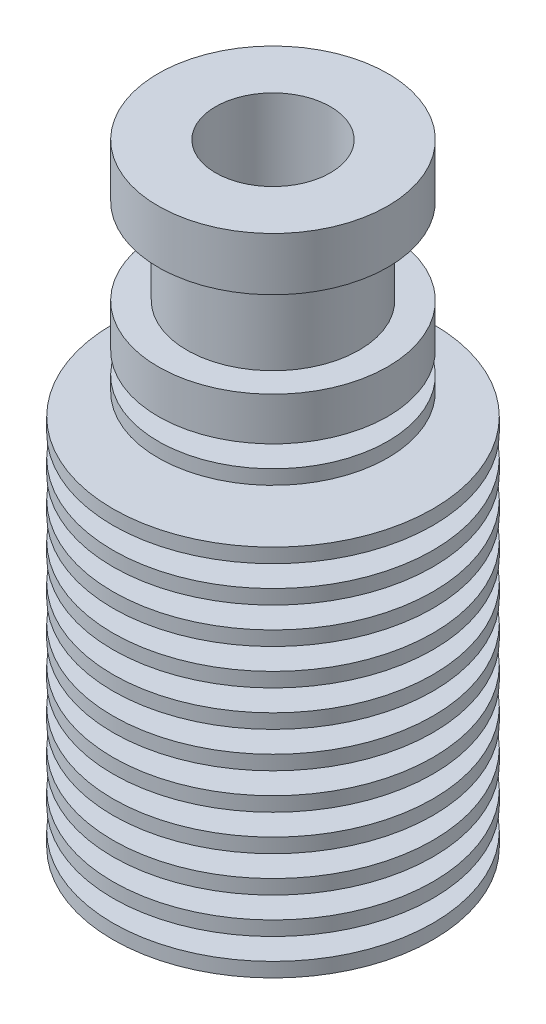
ISO-10303-21;
HEADER;
FILE_DESCRIPTION(('STEP AP214'),'2;1');
FILE_NAME('part.step','',(''),(''),'','','');
FILE_SCHEMA(('AUTOMOTIVE_DESIGN { 1 0 10303 214 1 1 1 1 }'));
ENDSEC;
DATA;
#1=APPLICATION_CONTEXT('core data for automotive mechanical design processes');
#2=APPLICATION_PROTOCOL_DEFINITION('international standard','automotive_design',2000,#1);
#3=PRODUCT_CONTEXT('',#1,'mechanical');
#4=PRODUCT('Part','Part','',(#3));
#5=PRODUCT_RELATED_PRODUCT_CATEGORY('part','',(#4));
#6=PRODUCT_DEFINITION_FORMATION('','',#4);
#7=PRODUCT_DEFINITION_CONTEXT('part definition',#1,'design');
#8=PRODUCT_DEFINITION('design','',#6,#7);
#9=PRODUCT_DEFINITION_SHAPE('','',#8);
#10=(LENGTH_UNIT() NAMED_UNIT(*) SI_UNIT(.MILLI.,.METRE.));
#11=(NAMED_UNIT(*) PLANE_ANGLE_UNIT() SI_UNIT($,.RADIAN.));
#12=(NAMED_UNIT(*) SI_UNIT($,.STERADIAN.) SOLID_ANGLE_UNIT());
#13=UNCERTAINTY_MEASURE_WITH_UNIT(LENGTH_MEASURE(1.E-05),#10,'distance_accuracy_value','');
#14=(GEOMETRIC_REPRESENTATION_CONTEXT(3) GLOBAL_UNCERTAINTY_ASSIGNED_CONTEXT((#13)) GLOBAL_UNIT_ASSIGNED_CONTEXT((#10,
#11,#12)) REPRESENTATION_CONTEXT('',''));
#15=CARTESIAN_POINT('',(0.,0.,0.));
#16=DIRECTION('',(0.,0.,1.));
#17=DIRECTION('',(1.,0.,0.));
#18=AXIS2_PLACEMENT_3D('',#15,#16,#17);
#19=CARTESIAN_POINT('',(0.,0.,0.));
#20=DIRECTION('',(0.,-1.,0.));
#21=DIRECTION('',(1.,0.,0.));
#22=AXIS2_PLACEMENT_3D('',#19,#20,#21);
#23=PLANE('',#22);
#24=CARTESIAN_POINT('',(0.,0.,0.));
#25=DIRECTION('',(0.,-1.,0.));
#26=DIRECTION('',(1.,0.,0.));
#27=AXIS2_PLACEMENT_3D('',#24,#25,#26);
#28=CIRCLE('',#27,4.);
#29=CARTESIAN_POINT('',(4.,0.,0.));
#30=VERTEX_POINT('',#29);
#31=EDGE_CURVE('E228',#30,#30,#28,.T.);
#32=ORIENTED_EDGE('',*,*,#31,.T.);
#33=EDGE_LOOP('',(#32));
#34=FACE_BOUND('',#33,.T.);
#35=CARTESIAN_POINT('',(0.,0.,0.));
#36=DIRECTION('',(0.,-1.,0.));
#37=DIRECTION('',(1.,0.,0.));
#38=AXIS2_PLACEMENT_3D('',#35,#36,#37);
#39=CIRCLE('',#38,8.00000000000001);
#40=CARTESIAN_POINT('',(8.00000000000001,0.,0.));
#41=VERTEX_POINT('',#40);
#42=EDGE_CURVE('E10',#41,#41,#39,.T.);
#43=ORIENTED_EDGE('',*,*,#42,.F.);
#44=EDGE_LOOP('',(#43));
#45=FACE_BOUND('',#44,.T.);
#46=ADVANCED_FACE('F32',(#34,#45),#23,.F.);
#47=CARTESIAN_POINT('',(0.,-42.7,0.));
#48=DIRECTION('',(0.,-1.,0.));
#49=DIRECTION('',(1.,0.,0.));
#50=AXIS2_PLACEMENT_3D('',#47,#48,#49);
#51=CYLINDRICAL_SURFACE('',#50,8.);
#52=CARTESIAN_POINT('',(0.,-3.7,0.));
#53=DIRECTION('',(0.,-1.,0.));
#54=DIRECTION('',(1.,0.,0.));
#55=AXIS2_PLACEMENT_3D('',#52,#53,#54);
#56=CIRCLE('',#55,8.);
#57=CARTESIAN_POINT('',(8.,-3.7,0.));
#58=VERTEX_POINT('',#57);
#59=EDGE_CURVE('E39',#58,#58,#56,.T.);
#60=ORIENTED_EDGE('',*,*,#59,.F.);
#61=EDGE_LOOP('',(#60));
#62=FACE_BOUND('',#61,.T.);
#63=ORIENTED_EDGE('',*,*,#42,.T.);
#64=EDGE_LOOP('',(#63));
#65=FACE_BOUND('',#64,.T.);
#66=ADVANCED_FACE('F715',(#62,#65),#51,.T.);
#67=CARTESIAN_POINT('',(-8.,-3.7,0.));
#68=DIRECTION('',(0.,1.,0.));
#69=DIRECTION('',(-1.,0.,0.));
#70=AXIS2_PLACEMENT_3D('',#67,#68,#69);
#71=PLANE('',#70);
#72=CARTESIAN_POINT('',(0.,-3.7,0.));
#73=DIRECTION('',(0.,-1.,0.));
#74=DIRECTION('',(1.,0.,0.));
#75=AXIS2_PLACEMENT_3D('',#72,#73,#74);
#76=CIRCLE('',#75,6.);
#77=CARTESIAN_POINT('',(6.,-3.7,0.));
#78=VERTEX_POINT('',#77);
#79=EDGE_CURVE('E43',#78,#78,#76,.T.);
#80=ORIENTED_EDGE('',*,*,#79,.F.);
#81=EDGE_LOOP('',(#80));
#82=FACE_BOUND('',#81,.T.);
#83=ORIENTED_EDGE('',*,*,#59,.T.);
#84=EDGE_LOOP('',(#83));
#85=FACE_BOUND('',#84,.T.);
#86=ADVANCED_FACE('F709',(#82,#85),#71,.F.);
#87=CARTESIAN_POINT('',(0.,-42.7,0.));
#88=DIRECTION('',(0.,-1.,0.));
#89=DIRECTION('',(1.,0.,0.));
#90=AXIS2_PLACEMENT_3D('',#87,#88,#89);
#91=CYLINDRICAL_SURFACE('',#90,6.);
#92=CARTESIAN_POINT('',(0.,-9.7,0.));
#93=DIRECTION('',(0.,-1.,0.));
#94=DIRECTION('',(1.,0.,0.));
#95=AXIS2_PLACEMENT_3D('',#92,#93,#94);
#96=CIRCLE('',#95,6.);
#97=CARTESIAN_POINT('',(6.,-9.7,0.));
#98=VERTEX_POINT('',#97);
#99=EDGE_CURVE('E48',#98,#98,#96,.T.);
#100=ORIENTED_EDGE('',*,*,#99,.F.);
#101=EDGE_LOOP('',(#100));
#102=FACE_BOUND('',#101,.T.);
#103=ORIENTED_EDGE('',*,*,#79,.T.);
#104=EDGE_LOOP('',(#103));
#105=FACE_BOUND('',#104,.T.);
#106=ADVANCED_FACE('F700',(#102,#105),#91,.T.);
#107=CARTESIAN_POINT('',(-6.,-9.7,0.));
#108=DIRECTION('',(0.,-1.,0.));
#109=DIRECTION('',(1.,0.,0.));
#110=AXIS2_PLACEMENT_3D('',#107,#108,#109);
#111=PLANE('',#110);
#112=CARTESIAN_POINT('',(0.,-9.7,0.));
#113=DIRECTION('',(0.,-1.,0.));
#114=DIRECTION('',(1.,0.,0.));
#115=AXIS2_PLACEMENT_3D('',#112,#113,#114);
#116=CIRCLE('',#115,8.00000000000001);
#117=CARTESIAN_POINT('',(8.00000000000001,-9.7,0.));
#118=VERTEX_POINT('',#117);
#119=EDGE_CURVE('E52',#118,#118,#116,.T.);
#120=ORIENTED_EDGE('',*,*,#119,.F.);
#121=EDGE_LOOP('',(#120));
#122=FACE_BOUND('',#121,.T.);
#123=ORIENTED_EDGE('',*,*,#99,.T.);
#124=EDGE_LOOP('',(#123));
#125=FACE_BOUND('',#124,.T.);
#126=ADVANCED_FACE('F692',(#122,#125),#111,.F.);
#127=CARTESIAN_POINT('',(0.,-42.7,0.));
#128=DIRECTION('',(0.,-1.,0.));
#129=DIRECTION('',(1.,0.,0.));
#130=AXIS2_PLACEMENT_3D('',#127,#128,#129);
#131=CYLINDRICAL_SURFACE('',#130,8.00000000000001);
#132=CARTESIAN_POINT('',(0.,-12.7,0.));
#133=DIRECTION('',(0.,-1.,0.));
#134=DIRECTION('',(1.,0.,0.));
#135=AXIS2_PLACEMENT_3D('',#132,#133,#134);
#136=CIRCLE('',#135,8.00000000000001);
#137=CARTESIAN_POINT('',(8.00000000000001,-12.7,0.));
#138=VERTEX_POINT('',#137);
#139=EDGE_CURVE('E56',#138,#138,#136,.T.);
#140=ORIENTED_EDGE('',*,*,#139,.F.);
#141=EDGE_LOOP('',(#140));
#142=FACE_BOUND('',#141,.T.);
#143=ORIENTED_EDGE('',*,*,#119,.T.);
#144=EDGE_LOOP('',(#143));
#145=FACE_BOUND('',#144,.T.);
#146=ADVANCED_FACE('F684',(#142,#145),#131,.T.);
#147=CARTESIAN_POINT('',(-8.00000000000001,-12.7,0.));
#148=DIRECTION('',(0.,1.,0.));
#149=DIRECTION('',(-1.,0.,0.));
#150=AXIS2_PLACEMENT_3D('',#147,#148,#149);
#151=PLANE('',#150);
#152=CARTESIAN_POINT('',(0.,-12.7,0.));
#153=DIRECTION('',(0.,-1.,0.));
#154=DIRECTION('',(1.,0.,0.));
#155=AXIS2_PLACEMENT_3D('',#152,#153,#154);
#156=CIRCLE('',#155,4.5);
#157=CARTESIAN_POINT('',(4.5,-12.7,0.));
#158=VERTEX_POINT('',#157);
#159=EDGE_CURVE('E59',#158,#158,#156,.T.);
#160=ORIENTED_EDGE('',*,*,#159,.F.);
#161=EDGE_LOOP('',(#160));
#162=FACE_BOUND('',#161,.T.);
#163=ORIENTED_EDGE('',*,*,#139,.T.);
#164=EDGE_LOOP('',(#163));
#165=FACE_BOUND('',#164,.T.);
#166=ADVANCED_FACE('F676',(#162,#165),#151,.F.);
#167=CARTESIAN_POINT('',(0.,-42.7,0.));
#168=DIRECTION('',(0.,-1.,0.));
#169=DIRECTION('',(1.,0.,0.));
#170=AXIS2_PLACEMENT_3D('',#167,#168,#169);
#171=CYLINDRICAL_SURFACE('',#170,4.5);
#172=CARTESIAN_POINT('',(0.,-14.2,0.));
#173=DIRECTION('',(0.,-1.,0.));
#174=DIRECTION('',(1.,0.,0.));
#175=AXIS2_PLACEMENT_3D('',#172,#173,#174);
#176=CIRCLE('',#175,4.5);
#177=CARTESIAN_POINT('',(4.5,-14.2,0.));
#178=VERTEX_POINT('',#177);
#179=EDGE_CURVE('E62',#178,#178,#176,.T.);
#180=ORIENTED_EDGE('',*,*,#179,.F.);
#181=EDGE_LOOP('',(#180));
#182=FACE_BOUND('',#181,.T.);
#183=ORIENTED_EDGE('',*,*,#159,.T.);
#184=EDGE_LOOP('',(#183));
#185=FACE_BOUND('',#184,.T.);
#186=ADVANCED_FACE('F668',(#182,#185),#171,.T.);
#187=CARTESIAN_POINT('',(-4.5,-14.2,0.));
#188=DIRECTION('',(0.,-1.,0.));
#189=DIRECTION('',(1.,0.,0.));
#190=AXIS2_PLACEMENT_3D('',#187,#188,#189);
#191=PLANE('',#190);
#192=CARTESIAN_POINT('',(0.,-14.2,0.));
#193=DIRECTION('',(0.,-1.,0.));
#194=DIRECTION('',(1.,0.,0.));
#195=AXIS2_PLACEMENT_3D('',#192,#193,#194);
#196=CIRCLE('',#195,8.00000000000001);
#197=CARTESIAN_POINT('',(8.00000000000001,-14.2,0.));
#198=VERTEX_POINT('',#197);
#199=EDGE_CURVE('E66',#198,#198,#196,.T.);
#200=ORIENTED_EDGE('',*,*,#199,.F.);
#201=EDGE_LOOP('',(#200));
#202=FACE_BOUND('',#201,.T.);
#203=ORIENTED_EDGE('',*,*,#179,.T.);
#204=EDGE_LOOP('',(#203));
#205=FACE_BOUND('',#204,.T.);
#206=ADVANCED_FACE('F660',(#202,#205),#191,.F.);
#207=CARTESIAN_POINT('',(0.,-42.7,0.));
#208=DIRECTION('',(0.,-1.,0.));
#209=DIRECTION('',(1.,0.,0.));
#210=AXIS2_PLACEMENT_3D('',#207,#208,#209);
#211=CYLINDRICAL_SURFACE('',#210,8.00000000000001);
#212=CARTESIAN_POINT('',(0.,-15.2,0.));
#213=DIRECTION('',(0.,-1.,0.));
#214=DIRECTION('',(1.,0.,0.));
#215=AXIS2_PLACEMENT_3D('',#212,#213,#214);
#216=CIRCLE('',#215,8.00000000000001);
#217=CARTESIAN_POINT('',(8.00000000000001,-15.2,0.));
#218=VERTEX_POINT('',#217);
#219=EDGE_CURVE('E70',#218,#218,#216,.T.);
#220=ORIENTED_EDGE('',*,*,#219,.F.);
#221=EDGE_LOOP('',(#220));
#222=FACE_BOUND('',#221,.T.);
#223=ORIENTED_EDGE('',*,*,#199,.T.);
#224=EDGE_LOOP('',(#223));
#225=FACE_BOUND('',#224,.T.);
#226=ADVANCED_FACE('F652',(#222,#225),#211,.T.);
#227=CARTESIAN_POINT('',(-8.00000000000001,-15.2,0.));
#228=DIRECTION('',(0.,1.,0.));
#229=DIRECTION('',(-1.,0.,0.));
#230=AXIS2_PLACEMENT_3D('',#227,#228,#229);
#231=PLANE('',#230);
#232=CARTESIAN_POINT('',(0.,-15.2,0.));
#233=DIRECTION('',(0.,-1.,0.));
#234=DIRECTION('',(1.,0.,0.));
#235=AXIS2_PLACEMENT_3D('',#232,#233,#234);
#236=CIRCLE('',#235,4.65909090909091);
#237=CARTESIAN_POINT('',(4.65909090909091,-15.2,0.));
#238=VERTEX_POINT('',#237);
#239=EDGE_CURVE('E73',#238,#238,#236,.T.);
#240=ORIENTED_EDGE('',*,*,#239,.F.);
#241=EDGE_LOOP('',(#240));
#242=FACE_BOUND('',#241,.T.);
#243=ORIENTED_EDGE('',*,*,#219,.T.);
#244=EDGE_LOOP('',(#243));
#245=FACE_BOUND('',#244,.T.);
#246=ADVANCED_FACE('F644',(#242,#245),#231,.F.);
#247=CARTESIAN_POINT('',(0.,-42.7,0.));
#248=DIRECTION('',(0.,-1.,0.));
#249=DIRECTION('',(1.,0.,0.));
#250=AXIS2_PLACEMENT_3D('',#247,#248,#249);
#251=CYLINDRICAL_SURFACE('',#250,4.65909090909091);
#252=CARTESIAN_POINT('',(0.,-16.7,0.));
#253=DIRECTION('',(0.,-1.,0.));
#254=DIRECTION('',(1.,0.,0.));
#255=AXIS2_PLACEMENT_3D('',#252,#253,#254);
#256=CIRCLE('',#255,4.65909090909091);
#257=CARTESIAN_POINT('',(4.65909090909091,-16.7,0.));
#258=VERTEX_POINT('',#257);
#259=EDGE_CURVE('E76',#258,#258,#256,.T.);
#260=ORIENTED_EDGE('',*,*,#259,.F.);
#261=EDGE_LOOP('',(#260));
#262=FACE_BOUND('',#261,.T.);
#263=ORIENTED_EDGE('',*,*,#239,.T.);
#264=EDGE_LOOP('',(#263));
#265=FACE_BOUND('',#264,.T.);
#266=ADVANCED_FACE('F636',(#262,#265),#251,.T.);
#267=CARTESIAN_POINT('',(-4.65909090909091,-16.7,0.));
#268=DIRECTION('',(0.,-1.,0.));
#269=DIRECTION('',(1.,0.,0.));
#270=AXIS2_PLACEMENT_3D('',#267,#268,#269);
#271=PLANE('',#270);
#272=CARTESIAN_POINT('',(0.,-16.7,0.));
#273=DIRECTION('',(0.,-1.,0.));
#274=DIRECTION('',(1.,0.,0.));
#275=AXIS2_PLACEMENT_3D('',#272,#273,#274);
#276=CIRCLE('',#275,11.15);
#277=CARTESIAN_POINT('',(11.15,-16.7,0.));
#278=VERTEX_POINT('',#277);
#279=EDGE_CURVE('E79',#278,#278,#276,.T.);
#280=ORIENTED_EDGE('',*,*,#279,.F.);
#281=EDGE_LOOP('',(#280));
#282=FACE_BOUND('',#281,.T.);
#283=ORIENTED_EDGE('',*,*,#259,.T.);
#284=EDGE_LOOP('',(#283));
#285=FACE_BOUND('',#284,.T.);
#286=ADVANCED_FACE('F628',(#282,#285),#271,.F.);
#287=CARTESIAN_POINT('',(0.,-42.7,0.));
#288=DIRECTION('',(0.,-1.,0.));
#289=DIRECTION('',(1.,0.,0.));
#290=AXIS2_PLACEMENT_3D('',#287,#288,#289);
#291=CYLINDRICAL_SURFACE('',#290,11.15);
#292=CARTESIAN_POINT('',(0.,-17.7,0.));
#293=DIRECTION('',(0.,-1.,0.));
#294=DIRECTION('',(1.,0.,0.));
#295=AXIS2_PLACEMENT_3D('',#292,#293,#294);
#296=CIRCLE('',#295,11.15);
#297=CARTESIAN_POINT('',(11.15,-17.7,0.));
#298=VERTEX_POINT('',#297);
#299=EDGE_CURVE('E82',#298,#298,#296,.T.);
#300=ORIENTED_EDGE('',*,*,#299,.F.);
#301=EDGE_LOOP('',(#300));
#302=FACE_BOUND('',#301,.T.);
#303=ORIENTED_EDGE('',*,*,#279,.T.);
#304=EDGE_LOOP('',(#303));
#305=FACE_BOUND('',#304,.T.);
#306=ADVANCED_FACE('F620',(#302,#305),#291,.T.);
#307=CARTESIAN_POINT('',(-11.15,-17.7,0.));
#308=DIRECTION('',(0.,1.,0.));
#309=DIRECTION('',(-1.,0.,0.));
#310=AXIS2_PLACEMENT_3D('',#307,#308,#309);
#311=PLANE('',#310);
#312=CARTESIAN_POINT('',(0.,-17.7,0.));
#313=DIRECTION('',(0.,-1.,0.));
#314=DIRECTION('',(1.,0.,0.));
#315=AXIS2_PLACEMENT_3D('',#312,#313,#314);
#316=CIRCLE('',#315,4.81818181818182);
#317=CARTESIAN_POINT('',(4.81818181818182,-17.7,0.));
#318=VERTEX_POINT('',#317);
#319=EDGE_CURVE('E85',#318,#318,#316,.T.);
#320=ORIENTED_EDGE('',*,*,#319,.F.);
#321=EDGE_LOOP('',(#320));
#322=FACE_BOUND('',#321,.T.);
#323=ORIENTED_EDGE('',*,*,#299,.T.);
#324=EDGE_LOOP('',(#323));
#325=FACE_BOUND('',#324,.T.);
#326=ADVANCED_FACE('F612',(#322,#325),#311,.F.);
#327=CARTESIAN_POINT('',(0.,-42.7,0.));
#328=DIRECTION('',(0.,-1.,0.));
#329=DIRECTION('',(1.,0.,0.));
#330=AXIS2_PLACEMENT_3D('',#327,#328,#329);
#331=CYLINDRICAL_SURFACE('',#330,4.81818181818182);
#332=CARTESIAN_POINT('',(0.,-19.2,0.));
#333=DIRECTION('',(0.,-1.,0.));
#334=DIRECTION('',(1.,0.,0.));
#335=AXIS2_PLACEMENT_3D('',#332,#333,#334);
#336=CIRCLE('',#335,4.81818181818182);
#337=CARTESIAN_POINT('',(4.81818181818182,-19.2,0.));
#338=VERTEX_POINT('',#337);
#339=EDGE_CURVE('E89',#338,#338,#336,.T.);
#340=ORIENTED_EDGE('',*,*,#339,.F.);
#341=EDGE_LOOP('',(#340));
#342=FACE_BOUND('',#341,.T.);
#343=ORIENTED_EDGE('',*,*,#319,.T.);
#344=EDGE_LOOP('',(#343));
#345=FACE_BOUND('',#344,.T.);
#346=ADVANCED_FACE('F604',(#342,#345),#331,.T.);
#347=CARTESIAN_POINT('',(-4.81818181818182,-19.2,0.));
#348=DIRECTION('',(0.,-1.,0.));
#349=DIRECTION('',(1.,0.,0.));
#350=AXIS2_PLACEMENT_3D('',#347,#348,#349);
#351=PLANE('',#350);
#352=CARTESIAN_POINT('',(0.,-19.2,0.));
#353=DIRECTION('',(0.,-1.,0.));
#354=DIRECTION('',(1.,0.,0.));
#355=AXIS2_PLACEMENT_3D('',#352,#353,#354);
#356=CIRCLE('',#355,11.15);
#357=CARTESIAN_POINT('',(11.15,-19.2,0.));
#358=VERTEX_POINT('',#357);
#359=EDGE_CURVE('E92',#358,#358,#356,.T.);
#360=ORIENTED_EDGE('',*,*,#359,.F.);
#361=EDGE_LOOP('',(#360));
#362=FACE_BOUND('',#361,.T.);
#363=ORIENTED_EDGE('',*,*,#339,.T.);
#364=EDGE_LOOP('',(#363));
#365=FACE_BOUND('',#364,.T.);
#366=ADVANCED_FACE('F596',(#362,#365),#351,.F.);
#367=CARTESIAN_POINT('',(0.,-42.7,0.));
#368=DIRECTION('',(0.,-1.,0.));
#369=DIRECTION('',(1.,0.,0.));
#370=AXIS2_PLACEMENT_3D('',#367,#368,#369);
#371=CYLINDRICAL_SURFACE('',#370,11.15);
#372=CARTESIAN_POINT('',(0.,-20.2,0.));
#373=DIRECTION('',(0.,-1.,0.));
#374=DIRECTION('',(1.,0.,0.));
#375=AXIS2_PLACEMENT_3D('',#372,#373,#374);
#376=CIRCLE('',#375,11.15);
#377=CARTESIAN_POINT('',(11.15,-20.2,0.));
#378=VERTEX_POINT('',#377);
#379=EDGE_CURVE('E96',#378,#378,#376,.T.);
#380=ORIENTED_EDGE('',*,*,#379,.F.);
#381=EDGE_LOOP('',(#380));
#382=FACE_BOUND('',#381,.T.);
#383=ORIENTED_EDGE('',*,*,#359,.T.);
#384=EDGE_LOOP('',(#383));
#385=FACE_BOUND('',#384,.T.);
#386=ADVANCED_FACE('F588',(#382,#385),#371,.T.);
#387=CARTESIAN_POINT('',(-11.15,-20.2,0.));
#388=DIRECTION('',(0.,1.,0.));
#389=DIRECTION('',(-1.,0.,0.));
#390=AXIS2_PLACEMENT_3D('',#387,#388,#389);
#391=PLANE('',#390);
#392=CARTESIAN_POINT('',(0.,-20.2,0.));
#393=DIRECTION('',(0.,-1.,0.));
#394=DIRECTION('',(1.,0.,0.));
#395=AXIS2_PLACEMENT_3D('',#392,#393,#394);
#396=CIRCLE('',#395,4.97727272727273);
#397=CARTESIAN_POINT('',(4.97727272727273,-20.2,0.));
#398=VERTEX_POINT('',#397);
#399=EDGE_CURVE('E100',#398,#398,#396,.T.);
#400=ORIENTED_EDGE('',*,*,#399,.F.);
#401=EDGE_LOOP('',(#400));
#402=FACE_BOUND('',#401,.T.);
#403=ORIENTED_EDGE('',*,*,#379,.T.);
#404=EDGE_LOOP('',(#403));
#405=FACE_BOUND('',#404,.T.);
#406=ADVANCED_FACE('F580',(#402,#405),#391,.F.);
#407=CARTESIAN_POINT('',(0.,-42.7,0.));
#408=DIRECTION('',(0.,-1.,0.));
#409=DIRECTION('',(1.,0.,0.));
#410=AXIS2_PLACEMENT_3D('',#407,#408,#409);
#411=CYLINDRICAL_SURFACE('',#410,4.97727272727273);
#412=CARTESIAN_POINT('',(0.,-21.7,0.));
#413=DIRECTION('',(0.,-1.,0.));
#414=DIRECTION('',(1.,0.,0.));
#415=AXIS2_PLACEMENT_3D('',#412,#413,#414);
#416=CIRCLE('',#415,4.97727272727273);
#417=CARTESIAN_POINT('',(4.97727272727273,-21.7,0.));
#418=VERTEX_POINT('',#417);
#419=EDGE_CURVE('E103',#418,#418,#416,.T.);
#420=ORIENTED_EDGE('',*,*,#419,.F.);
#421=EDGE_LOOP('',(#420));
#422=FACE_BOUND('',#421,.T.);
#423=ORIENTED_EDGE('',*,*,#399,.T.);
#424=EDGE_LOOP('',(#423));
#425=FACE_BOUND('',#424,.T.);
#426=ADVANCED_FACE('F572',(#422,#425),#411,.T.);
#427=CARTESIAN_POINT('',(-4.97727272727273,-21.7,0.));
#428=DIRECTION('',(0.,-1.,0.));
#429=DIRECTION('',(1.,0.,0.));
#430=AXIS2_PLACEMENT_3D('',#427,#428,#429);
#431=PLANE('',#430);
#432=CARTESIAN_POINT('',(0.,-21.7,0.));
#433=DIRECTION('',(0.,-1.,0.));
#434=DIRECTION('',(1.,0.,0.));
#435=AXIS2_PLACEMENT_3D('',#432,#433,#434);
#436=CIRCLE('',#435,11.15);
#437=CARTESIAN_POINT('',(11.15,-21.7,0.));
#438=VERTEX_POINT('',#437);
#439=EDGE_CURVE('E106',#438,#438,#436,.T.);
#440=ORIENTED_EDGE('',*,*,#439,.F.);
#441=EDGE_LOOP('',(#440));
#442=FACE_BOUND('',#441,.T.);
#443=ORIENTED_EDGE('',*,*,#419,.T.);
#444=EDGE_LOOP('',(#443));
#445=FACE_BOUND('',#444,.T.);
#446=ADVANCED_FACE('F564',(#442,#445),#431,.F.);
#447=CARTESIAN_POINT('',(0.,-42.7,0.));
#448=DIRECTION('',(0.,-1.,0.));
#449=DIRECTION('',(1.,0.,0.));
#450=AXIS2_PLACEMENT_3D('',#447,#448,#449);
#451=CYLINDRICAL_SURFACE('',#450,11.15);
#452=CARTESIAN_POINT('',(0.,-22.7,0.));
#453=DIRECTION('',(0.,-1.,0.));
#454=DIRECTION('',(1.,0.,0.));
#455=AXIS2_PLACEMENT_3D('',#452,#453,#454);
#456=CIRCLE('',#455,11.15);
#457=CARTESIAN_POINT('',(11.15,-22.7,0.));
#458=VERTEX_POINT('',#457);
#459=EDGE_CURVE('E109',#458,#458,#456,.T.);
#460=ORIENTED_EDGE('',*,*,#459,.F.);
#461=EDGE_LOOP('',(#460));
#462=FACE_BOUND('',#461,.T.);
#463=ORIENTED_EDGE('',*,*,#439,.T.);
#464=EDGE_LOOP('',(#463));
#465=FACE_BOUND('',#464,.T.);
#466=ADVANCED_FACE('F556',(#462,#465),#451,.T.);
#467=CARTESIAN_POINT('',(-11.15,-22.7,0.));
#468=DIRECTION('',(0.,1.,0.));
#469=DIRECTION('',(-1.,0.,0.));
#470=AXIS2_PLACEMENT_3D('',#467,#468,#469);
#471=PLANE('',#470);
#472=CARTESIAN_POINT('',(0.,-22.7,0.));
#473=DIRECTION('',(0.,-1.,0.));
#474=DIRECTION('',(1.,0.,0.));
#475=AXIS2_PLACEMENT_3D('',#472,#473,#474);
#476=CIRCLE('',#475,5.13636363636364);
#477=CARTESIAN_POINT('',(5.13636363636364,-22.7,0.));
#478=VERTEX_POINT('',#477);
#479=EDGE_CURVE('E112',#478,#478,#476,.T.);
#480=ORIENTED_EDGE('',*,*,#479,.F.);
#481=EDGE_LOOP('',(#480));
#482=FACE_BOUND('',#481,.T.);
#483=ORIENTED_EDGE('',*,*,#459,.T.);
#484=EDGE_LOOP('',(#483));
#485=FACE_BOUND('',#484,.T.);
#486=ADVANCED_FACE('F548',(#482,#485),#471,.F.);
#487=CARTESIAN_POINT('',(0.,-42.7,0.));
#488=DIRECTION('',(0.,-1.,0.));
#489=DIRECTION('',(1.,0.,0.));
#490=AXIS2_PLACEMENT_3D('',#487,#488,#489);
#491=CYLINDRICAL_SURFACE('',#490,5.13636363636364);
#492=CARTESIAN_POINT('',(0.,-24.2,0.));
#493=DIRECTION('',(0.,-1.,0.));
#494=DIRECTION('',(1.,0.,0.));
#495=AXIS2_PLACEMENT_3D('',#492,#493,#494);
#496=CIRCLE('',#495,5.13636363636364);
#497=CARTESIAN_POINT('',(5.13636363636364,-24.2,0.));
#498=VERTEX_POINT('',#497);
#499=EDGE_CURVE('E115',#498,#498,#496,.T.);
#500=ORIENTED_EDGE('',*,*,#499,.F.);
#501=EDGE_LOOP('',(#500));
#502=FACE_BOUND('',#501,.T.);
#503=ORIENTED_EDGE('',*,*,#479,.T.);
#504=EDGE_LOOP('',(#503));
#505=FACE_BOUND('',#504,.T.);
#506=ADVANCED_FACE('F540',(#502,#505),#491,.T.);
#507=CARTESIAN_POINT('',(-5.13636363636364,-24.2,0.));
#508=DIRECTION('',(0.,-1.,0.));
#509=DIRECTION('',(1.,0.,0.));
#510=AXIS2_PLACEMENT_3D('',#507,#508,#509);
#511=PLANE('',#510);
#512=CARTESIAN_POINT('',(0.,-24.2,0.));
#513=DIRECTION('',(0.,-1.,0.));
#514=DIRECTION('',(1.,0.,0.));
#515=AXIS2_PLACEMENT_3D('',#512,#513,#514);
#516=CIRCLE('',#515,11.15);
#517=CARTESIAN_POINT('',(11.15,-24.2,0.));
#518=VERTEX_POINT('',#517);
#519=EDGE_CURVE('E118',#518,#518,#516,.T.);
#520=ORIENTED_EDGE('',*,*,#519,.F.);
#521=EDGE_LOOP('',(#520));
#522=FACE_BOUND('',#521,.T.);
#523=ORIENTED_EDGE('',*,*,#499,.T.);
#524=EDGE_LOOP('',(#523));
#525=FACE_BOUND('',#524,.T.);
#526=ADVANCED_FACE('F532',(#522,#525),#511,.F.);
#527=CARTESIAN_POINT('',(0.,-42.7,0.));
#528=DIRECTION('',(0.,-1.,0.));
#529=DIRECTION('',(1.,0.,0.));
#530=AXIS2_PLACEMENT_3D('',#527,#528,#529);
#531=CYLINDRICAL_SURFACE('',#530,11.15);
#532=CARTESIAN_POINT('',(0.,-25.2,0.));
#533=DIRECTION('',(0.,-1.,0.));
#534=DIRECTION('',(1.,0.,0.));
#535=AXIS2_PLACEMENT_3D('',#532,#533,#534);
#536=CIRCLE('',#535,11.15);
#537=CARTESIAN_POINT('',(11.15,-25.2,0.));
#538=VERTEX_POINT('',#537);
#539=EDGE_CURVE('E122',#538,#538,#536,.T.);
#540=ORIENTED_EDGE('',*,*,#539,.F.);
#541=EDGE_LOOP('',(#540));
#542=FACE_BOUND('',#541,.T.);
#543=ORIENTED_EDGE('',*,*,#519,.T.);
#544=EDGE_LOOP('',(#543));
#545=FACE_BOUND('',#544,.T.);
#546=ADVANCED_FACE('F524',(#542,#545),#531,.T.);
#547=CARTESIAN_POINT('',(-11.15,-25.2,0.));
#548=DIRECTION('',(0.,1.,0.));
#549=DIRECTION('',(-1.,0.,0.));
#550=AXIS2_PLACEMENT_3D('',#547,#548,#549);
#551=PLANE('',#550);
#552=CARTESIAN_POINT('',(0.,-25.2,0.));
#553=DIRECTION('',(0.,-1.,0.));
#554=DIRECTION('',(1.,0.,0.));
#555=AXIS2_PLACEMENT_3D('',#552,#553,#554);
#556=CIRCLE('',#555,5.29545454545455);
#557=CARTESIAN_POINT('',(5.29545454545455,-25.2,0.));
#558=VERTEX_POINT('',#557);
#559=EDGE_CURVE('E125',#558,#558,#556,.T.);
#560=ORIENTED_EDGE('',*,*,#559,.F.);
#561=EDGE_LOOP('',(#560));
#562=FACE_BOUND('',#561,.T.);
#563=ORIENTED_EDGE('',*,*,#539,.T.);
#564=EDGE_LOOP('',(#563));
#565=FACE_BOUND('',#564,.T.);
#566=ADVANCED_FACE('F516',(#562,#565),#551,.F.);
#567=CARTESIAN_POINT('',(0.,-42.7,0.));
#568=DIRECTION('',(0.,-1.,0.));
#569=DIRECTION('',(1.,0.,0.));
#570=AXIS2_PLACEMENT_3D('',#567,#568,#569);
#571=CYLINDRICAL_SURFACE('',#570,5.29545454545455);
#572=CARTESIAN_POINT('',(0.,-26.7,0.));
#573=DIRECTION('',(0.,-1.,0.));
#574=DIRECTION('',(1.,0.,0.));
#575=AXIS2_PLACEMENT_3D('',#572,#573,#574);
#576=CIRCLE('',#575,5.29545454545455);
#577=CARTESIAN_POINT('',(5.29545454545455,-26.7,0.));
#578=VERTEX_POINT('',#577);
#579=EDGE_CURVE('E129',#578,#578,#576,.T.);
#580=ORIENTED_EDGE('',*,*,#579,.F.);
#581=EDGE_LOOP('',(#580));
#582=FACE_BOUND('',#581,.T.);
#583=ORIENTED_EDGE('',*,*,#559,.T.);
#584=EDGE_LOOP('',(#583));
#585=FACE_BOUND('',#584,.T.);
#586=ADVANCED_FACE('F508',(#582,#585),#571,.T.);
#587=CARTESIAN_POINT('',(-5.29545454545455,-26.7,0.));
#588=DIRECTION('',(0.,-1.,0.));
#589=DIRECTION('',(1.,0.,0.));
#590=AXIS2_PLACEMENT_3D('',#587,#588,#589);
#591=PLANE('',#590);
#592=CARTESIAN_POINT('',(0.,-26.7,0.));
#593=DIRECTION('',(0.,-1.,0.));
#594=DIRECTION('',(1.,0.,0.));
#595=AXIS2_PLACEMENT_3D('',#592,#593,#594);
#596=CIRCLE('',#595,11.15);
#597=CARTESIAN_POINT('',(11.15,-26.7,0.));
#598=VERTEX_POINT('',#597);
#599=EDGE_CURVE('E132',#598,#598,#596,.T.);
#600=ORIENTED_EDGE('',*,*,#599,.F.);
#601=EDGE_LOOP('',(#600));
#602=FACE_BOUND('',#601,.T.);
#603=ORIENTED_EDGE('',*,*,#579,.T.);
#604=EDGE_LOOP('',(#603));
#605=FACE_BOUND('',#604,.T.);
#606=ADVANCED_FACE('F500',(#602,#605),#591,.F.);
#607=CARTESIAN_POINT('',(0.,-42.7,0.));
#608=DIRECTION('',(0.,-1.,0.));
#609=DIRECTION('',(1.,0.,0.));
#610=AXIS2_PLACEMENT_3D('',#607,#608,#609);
#611=CYLINDRICAL_SURFACE('',#610,11.15);
#612=CARTESIAN_POINT('',(0.,-27.7,0.));
#613=DIRECTION('',(0.,-1.,0.));
#614=DIRECTION('',(1.,0.,0.));
#615=AXIS2_PLACEMENT_3D('',#612,#613,#614);
#616=CIRCLE('',#615,11.15);
#617=CARTESIAN_POINT('',(11.15,-27.7,0.));
#618=VERTEX_POINT('',#617);
#619=EDGE_CURVE('E135',#618,#618,#616,.T.);
#620=ORIENTED_EDGE('',*,*,#619,.F.);
#621=EDGE_LOOP('',(#620));
#622=FACE_BOUND('',#621,.T.);
#623=ORIENTED_EDGE('',*,*,#599,.T.);
#624=EDGE_LOOP('',(#623));
#625=FACE_BOUND('',#624,.T.);
#626=ADVANCED_FACE('F492',(#622,#625),#611,.T.);
#627=CARTESIAN_POINT('',(-11.15,-27.7,0.));
#628=DIRECTION('',(0.,1.,0.));
#629=DIRECTION('',(-1.,0.,0.));
#630=AXIS2_PLACEMENT_3D('',#627,#628,#629);
#631=PLANE('',#630);
#632=CARTESIAN_POINT('',(0.,-27.7,0.));
#633=DIRECTION('',(0.,-1.,0.));
#634=DIRECTION('',(1.,0.,0.));
#635=AXIS2_PLACEMENT_3D('',#632,#633,#634);
#636=CIRCLE('',#635,5.45454545454546);
#637=CARTESIAN_POINT('',(5.45454545454546,-27.7,0.));
#638=VERTEX_POINT('',#637);
#639=EDGE_CURVE('E138',#638,#638,#636,.T.);
#640=ORIENTED_EDGE('',*,*,#639,.F.);
#641=EDGE_LOOP('',(#640));
#642=FACE_BOUND('',#641,.T.);
#643=ORIENTED_EDGE('',*,*,#619,.T.);
#644=EDGE_LOOP('',(#643));
#645=FACE_BOUND('',#644,.T.);
#646=ADVANCED_FACE('F484',(#642,#645),#631,.F.);
#647=CARTESIAN_POINT('',(0.,-42.7,0.));
#648=DIRECTION('',(0.,-1.,0.));
#649=DIRECTION('',(1.,0.,0.));
#650=AXIS2_PLACEMENT_3D('',#647,#648,#649);
#651=CYLINDRICAL_SURFACE('',#650,5.45454545454546);
#652=CARTESIAN_POINT('',(0.,-29.2,0.));
#653=DIRECTION('',(0.,-1.,0.));
#654=DIRECTION('',(1.,0.,0.));
#655=AXIS2_PLACEMENT_3D('',#652,#653,#654);
#656=CIRCLE('',#655,5.45454545454546);
#657=CARTESIAN_POINT('',(5.45454545454546,-29.2,0.));
#658=VERTEX_POINT('',#657);
#659=EDGE_CURVE('E141',#658,#658,#656,.T.);
#660=ORIENTED_EDGE('',*,*,#659,.F.);
#661=EDGE_LOOP('',(#660));
#662=FACE_BOUND('',#661,.T.);
#663=ORIENTED_EDGE('',*,*,#639,.T.);
#664=EDGE_LOOP('',(#663));
#665=FACE_BOUND('',#664,.T.);
#666=ADVANCED_FACE('F476',(#662,#665),#651,.T.);
#667=CARTESIAN_POINT('',(-5.45454545454546,-29.2,0.));
#668=DIRECTION('',(0.,-1.,0.));
#669=DIRECTION('',(1.,0.,0.));
#670=AXIS2_PLACEMENT_3D('',#667,#668,#669);
#671=PLANE('',#670);
#672=CARTESIAN_POINT('',(0.,-29.2,0.));
#673=DIRECTION('',(0.,-1.,0.));
#674=DIRECTION('',(1.,0.,0.));
#675=AXIS2_PLACEMENT_3D('',#672,#673,#674);
#676=CIRCLE('',#675,11.15);
#677=CARTESIAN_POINT('',(11.15,-29.2,0.));
#678=VERTEX_POINT('',#677);
#679=EDGE_CURVE('E144',#678,#678,#676,.T.);
#680=ORIENTED_EDGE('',*,*,#679,.F.);
#681=EDGE_LOOP('',(#680));
#682=FACE_BOUND('',#681,.T.);
#683=ORIENTED_EDGE('',*,*,#659,.T.);
#684=EDGE_LOOP('',(#683));
#685=FACE_BOUND('',#684,.T.);
#686=ADVANCED_FACE('F468',(#682,#685),#671,.F.);
#687=CARTESIAN_POINT('',(0.,-42.7,0.));
#688=DIRECTION('',(0.,-1.,0.));
#689=DIRECTION('',(1.,0.,0.));
#690=AXIS2_PLACEMENT_3D('',#687,#688,#689);
#691=CYLINDRICAL_SURFACE('',#690,11.15);
#692=CARTESIAN_POINT('',(0.,-30.2,0.));
#693=DIRECTION('',(0.,-1.,0.));
#694=DIRECTION('',(1.,0.,0.));
#695=AXIS2_PLACEMENT_3D('',#692,#693,#694);
#696=CIRCLE('',#695,11.15);
#697=CARTESIAN_POINT('',(11.15,-30.2,0.));
#698=VERTEX_POINT('',#697);
#699=EDGE_CURVE('E147',#698,#698,#696,.T.);
#700=ORIENTED_EDGE('',*,*,#699,.F.);
#701=EDGE_LOOP('',(#700));
#702=FACE_BOUND('',#701,.T.);
#703=ORIENTED_EDGE('',*,*,#679,.T.);
#704=EDGE_LOOP('',(#703));
#705=FACE_BOUND('',#704,.T.);
#706=ADVANCED_FACE('F460',(#702,#705),#691,.T.);
#707=CARTESIAN_POINT('',(-11.15,-30.2,0.));
#708=DIRECTION('',(0.,1.,0.));
#709=DIRECTION('',(-1.,0.,0.));
#710=AXIS2_PLACEMENT_3D('',#707,#708,#709);
#711=PLANE('',#710);
#712=CARTESIAN_POINT('',(0.,-30.2,0.));
#713=DIRECTION('',(0.,-1.,0.));
#714=DIRECTION('',(1.,0.,0.));
#715=AXIS2_PLACEMENT_3D('',#712,#713,#714);
#716=CIRCLE('',#715,5.61363636363637);
#717=CARTESIAN_POINT('',(5.61363636363637,-30.2,0.));
#718=VERTEX_POINT('',#717);
#719=EDGE_CURVE('E150',#718,#718,#716,.T.);
#720=ORIENTED_EDGE('',*,*,#719,.F.);
#721=EDGE_LOOP('',(#720));
#722=FACE_BOUND('',#721,.T.);
#723=ORIENTED_EDGE('',*,*,#699,.T.);
#724=EDGE_LOOP('',(#723));
#725=FACE_BOUND('',#724,.T.);
#726=ADVANCED_FACE('F452',(#722,#725),#711,.F.);
#727=CARTESIAN_POINT('',(0.,-42.7,0.));
#728=DIRECTION('',(0.,-1.,0.));
#729=DIRECTION('',(1.,0.,0.));
#730=AXIS2_PLACEMENT_3D('',#727,#728,#729);
#731=CYLINDRICAL_SURFACE('',#730,5.61363636363636);
#732=CARTESIAN_POINT('',(0.,-31.7,0.));
#733=DIRECTION('',(0.,-1.,0.));
#734=DIRECTION('',(1.,0.,0.));
#735=AXIS2_PLACEMENT_3D('',#732,#733,#734);
#736=CIRCLE('',#735,5.61363636363636);
#737=CARTESIAN_POINT('',(5.61363636363636,-31.7,0.));
#738=VERTEX_POINT('',#737);
#739=EDGE_CURVE('E154',#738,#738,#736,.T.);
#740=ORIENTED_EDGE('',*,*,#739,.F.);
#741=EDGE_LOOP('',(#740));
#742=FACE_BOUND('',#741,.T.);
#743=ORIENTED_EDGE('',*,*,#719,.T.);
#744=EDGE_LOOP('',(#743));
#745=FACE_BOUND('',#744,.T.);
#746=ADVANCED_FACE('F444',(#742,#745),#731,.T.);
#747=CARTESIAN_POINT('',(-5.61363636363636,-31.7,0.));
#748=DIRECTION('',(0.,-1.,0.));
#749=DIRECTION('',(1.,0.,0.));
#750=AXIS2_PLACEMENT_3D('',#747,#748,#749);
#751=PLANE('',#750);
#752=CARTESIAN_POINT('',(0.,-31.7,0.));
#753=DIRECTION('',(0.,-1.,0.));
#754=DIRECTION('',(1.,0.,0.));
#755=AXIS2_PLACEMENT_3D('',#752,#753,#754);
#756=CIRCLE('',#755,11.15);
#757=CARTESIAN_POINT('',(11.15,-31.7,0.));
#758=VERTEX_POINT('',#757);
#759=EDGE_CURVE('E158',#758,#758,#756,.T.);
#760=ORIENTED_EDGE('',*,*,#759,.F.);
#761=EDGE_LOOP('',(#760));
#762=FACE_BOUND('',#761,.T.);
#763=ORIENTED_EDGE('',*,*,#739,.T.);
#764=EDGE_LOOP('',(#763));
#765=FACE_BOUND('',#764,.T.);
#766=ADVANCED_FACE('F436',(#762,#765),#751,.F.);
#767=CARTESIAN_POINT('',(0.,-42.7,0.));
#768=DIRECTION('',(0.,-1.,0.));
#769=DIRECTION('',(1.,0.,0.));
#770=AXIS2_PLACEMENT_3D('',#767,#768,#769);
#771=CYLINDRICAL_SURFACE('',#770,11.15);
#772=CARTESIAN_POINT('',(0.,-32.7,0.));
#773=DIRECTION('',(0.,-1.,0.));
#774=DIRECTION('',(1.,0.,0.));
#775=AXIS2_PLACEMENT_3D('',#772,#773,#774);
#776=CIRCLE('',#775,11.15);
#777=CARTESIAN_POINT('',(11.15,-32.7,0.));
#778=VERTEX_POINT('',#777);
#779=EDGE_CURVE('E161',#778,#778,#776,.T.);
#780=ORIENTED_EDGE('',*,*,#779,.F.);
#781=EDGE_LOOP('',(#780));
#782=FACE_BOUND('',#781,.T.);
#783=ORIENTED_EDGE('',*,*,#759,.T.);
#784=EDGE_LOOP('',(#783));
#785=FACE_BOUND('',#784,.T.);
#786=ADVANCED_FACE('F428',(#782,#785),#771,.T.);
#787=CARTESIAN_POINT('',(-11.15,-32.7,0.));
#788=DIRECTION('',(0.,1.,0.));
#789=DIRECTION('',(-1.,0.,0.));
#790=AXIS2_PLACEMENT_3D('',#787,#788,#789);
#791=PLANE('',#790);
#792=CARTESIAN_POINT('',(0.,-32.7,0.));
#793=DIRECTION('',(0.,-1.,0.));
#794=DIRECTION('',(1.,0.,0.));
#795=AXIS2_PLACEMENT_3D('',#792,#793,#794);
#796=CIRCLE('',#795,5.77272727272727);
#797=CARTESIAN_POINT('',(5.77272727272727,-32.7,0.));
#798=VERTEX_POINT('',#797);
#799=EDGE_CURVE('E164',#798,#798,#796,.T.);
#800=ORIENTED_EDGE('',*,*,#799,.F.);
#801=EDGE_LOOP('',(#800));
#802=FACE_BOUND('',#801,.T.);
#803=ORIENTED_EDGE('',*,*,#779,.T.);
#804=EDGE_LOOP('',(#803));
#805=FACE_BOUND('',#804,.T.);
#806=ADVANCED_FACE('F420',(#802,#805),#791,.F.);
#807=CARTESIAN_POINT('',(0.,-42.7,0.));
#808=DIRECTION('',(0.,-1.,0.));
#809=DIRECTION('',(1.,0.,0.));
#810=AXIS2_PLACEMENT_3D('',#807,#808,#809);
#811=CYLINDRICAL_SURFACE('',#810,5.77272727272727);
#812=CARTESIAN_POINT('',(0.,-34.2,0.));
#813=DIRECTION('',(0.,-1.,0.));
#814=DIRECTION('',(1.,0.,0.));
#815=AXIS2_PLACEMENT_3D('',#812,#813,#814);
#816=CIRCLE('',#815,5.77272727272727);
#817=CARTESIAN_POINT('',(5.77272727272727,-34.2,0.));
#818=VERTEX_POINT('',#817);
#819=EDGE_CURVE('E167',#818,#818,#816,.T.);
#820=ORIENTED_EDGE('',*,*,#819,.F.);
#821=EDGE_LOOP('',(#820));
#822=FACE_BOUND('',#821,.T.);
#823=ORIENTED_EDGE('',*,*,#799,.T.);
#824=EDGE_LOOP('',(#823));
#825=FACE_BOUND('',#824,.T.);
#826=ADVANCED_FACE('F412',(#822,#825),#811,.T.);
#827=CARTESIAN_POINT('',(-5.77272727272727,-34.2,0.));
#828=DIRECTION('',(0.,-1.,0.));
#829=DIRECTION('',(1.,0.,0.));
#830=AXIS2_PLACEMENT_3D('',#827,#828,#829);
#831=PLANE('',#830);
#832=CARTESIAN_POINT('',(0.,-34.2,0.));
#833=DIRECTION('',(0.,-1.,0.));
#834=DIRECTION('',(1.,0.,0.));
#835=AXIS2_PLACEMENT_3D('',#832,#833,#834);
#836=CIRCLE('',#835,11.15);
#837=CARTESIAN_POINT('',(11.15,-34.2,0.));
#838=VERTEX_POINT('',#837);
#839=EDGE_CURVE('E171',#838,#838,#836,.T.);
#840=ORIENTED_EDGE('',*,*,#839,.F.);
#841=EDGE_LOOP('',(#840));
#842=FACE_BOUND('',#841,.T.);
#843=ORIENTED_EDGE('',*,*,#819,.T.);
#844=EDGE_LOOP('',(#843));
#845=FACE_BOUND('',#844,.T.);
#846=ADVANCED_FACE('F404',(#842,#845),#831,.F.);
#847=CARTESIAN_POINT('',(0.,-42.7,0.));
#848=DIRECTION('',(0.,-1.,0.));
#849=DIRECTION('',(1.,0.,0.));
#850=AXIS2_PLACEMENT_3D('',#847,#848,#849);
#851=CYLINDRICAL_SURFACE('',#850,11.15);
#852=CARTESIAN_POINT('',(0.,-35.2,0.));
#853=DIRECTION('',(0.,-1.,0.));
#854=DIRECTION('',(1.,0.,0.));
#855=AXIS2_PLACEMENT_3D('',#852,#853,#854);
#856=CIRCLE('',#855,11.15);
#857=CARTESIAN_POINT('',(11.15,-35.2,0.));
#858=VERTEX_POINT('',#857);
#859=EDGE_CURVE('E174',#858,#858,#856,.T.);
#860=ORIENTED_EDGE('',*,*,#859,.F.);
#861=EDGE_LOOP('',(#860));
#862=FACE_BOUND('',#861,.T.);
#863=ORIENTED_EDGE('',*,*,#839,.T.);
#864=EDGE_LOOP('',(#863));
#865=FACE_BOUND('',#864,.T.);
#866=ADVANCED_FACE('F396',(#862,#865),#851,.T.);
#867=CARTESIAN_POINT('',(-11.15,-35.2,0.));
#868=DIRECTION('',(0.,1.,0.));
#869=DIRECTION('',(-1.,0.,0.));
#870=AXIS2_PLACEMENT_3D('',#867,#868,#869);
#871=PLANE('',#870);
#872=CARTESIAN_POINT('',(0.,-35.2,0.));
#873=DIRECTION('',(0.,-1.,0.));
#874=DIRECTION('',(1.,0.,0.));
#875=AXIS2_PLACEMENT_3D('',#872,#873,#874);
#876=CIRCLE('',#875,5.93181818181818);
#877=CARTESIAN_POINT('',(5.93181818181818,-35.2,0.));
#878=VERTEX_POINT('',#877);
#879=EDGE_CURVE('E177',#878,#878,#876,.T.);
#880=ORIENTED_EDGE('',*,*,#879,.F.);
#881=EDGE_LOOP('',(#880));
#882=FACE_BOUND('',#881,.T.);
#883=ORIENTED_EDGE('',*,*,#859,.T.);
#884=EDGE_LOOP('',(#883));
#885=FACE_BOUND('',#884,.T.);
#886=ADVANCED_FACE('F388',(#882,#885),#871,.F.);
#887=CARTESIAN_POINT('',(0.,-42.7,0.));
#888=DIRECTION('',(0.,-1.,0.));
#889=DIRECTION('',(1.,0.,0.));
#890=AXIS2_PLACEMENT_3D('',#887,#888,#889);
#891=CYLINDRICAL_SURFACE('',#890,5.93181818181818);
#892=CARTESIAN_POINT('',(0.,-36.7,0.));
#893=DIRECTION('',(0.,-1.,0.));
#894=DIRECTION('',(1.,0.,0.));
#895=AXIS2_PLACEMENT_3D('',#892,#893,#894);
#896=CIRCLE('',#895,5.93181818181817);
#897=CARTESIAN_POINT('',(5.93181818181817,-36.7,0.));
#898=VERTEX_POINT('',#897);
#899=EDGE_CURVE('E181',#898,#898,#896,.T.);
#900=ORIENTED_EDGE('',*,*,#899,.F.);
#901=EDGE_LOOP('',(#900));
#902=FACE_BOUND('',#901,.T.);
#903=ORIENTED_EDGE('',*,*,#879,.T.);
#904=EDGE_LOOP('',(#903));
#905=FACE_BOUND('',#904,.T.);
#906=ADVANCED_FACE('F380',(#902,#905),#891,.T.);
#907=CARTESIAN_POINT('',(-5.93181818181817,-36.7,0.));
#908=DIRECTION('',(0.,-1.,0.));
#909=DIRECTION('',(1.,0.,0.));
#910=AXIS2_PLACEMENT_3D('',#907,#908,#909);
#911=PLANE('',#910);
#912=CARTESIAN_POINT('',(0.,-36.7,0.));
#913=DIRECTION('',(0.,-1.,0.));
#914=DIRECTION('',(1.,0.,0.));
#915=AXIS2_PLACEMENT_3D('',#912,#913,#914);
#916=CIRCLE('',#915,11.15);
#917=CARTESIAN_POINT('',(11.15,-36.7,0.));
#918=VERTEX_POINT('',#917);
#919=EDGE_CURVE('E185',#918,#918,#916,.T.);
#920=ORIENTED_EDGE('',*,*,#919,.F.);
#921=EDGE_LOOP('',(#920));
#922=FACE_BOUND('',#921,.T.);
#923=ORIENTED_EDGE('',*,*,#899,.T.);
#924=EDGE_LOOP('',(#923));
#925=FACE_BOUND('',#924,.T.);
#926=ADVANCED_FACE('F372',(#922,#925),#911,.F.);
#927=CARTESIAN_POINT('',(0.,-42.7,0.));
#928=DIRECTION('',(0.,-1.,0.));
#929=DIRECTION('',(1.,0.,0.));
#930=AXIS2_PLACEMENT_3D('',#927,#928,#929);
#931=CYLINDRICAL_SURFACE('',#930,11.15);
#932=CARTESIAN_POINT('',(0.,-37.7,0.));
#933=DIRECTION('',(0.,-1.,0.));
#934=DIRECTION('',(1.,0.,0.));
#935=AXIS2_PLACEMENT_3D('',#932,#933,#934);
#936=CIRCLE('',#935,11.15);
#937=CARTESIAN_POINT('',(11.15,-37.7,0.));
#938=VERTEX_POINT('',#937);
#939=EDGE_CURVE('E188',#938,#938,#936,.T.);
#940=ORIENTED_EDGE('',*,*,#939,.F.);
#941=EDGE_LOOP('',(#940));
#942=FACE_BOUND('',#941,.T.);
#943=ORIENTED_EDGE('',*,*,#919,.T.);
#944=EDGE_LOOP('',(#943));
#945=FACE_BOUND('',#944,.T.);
#946=ADVANCED_FACE('F364',(#942,#945),#931,.T.);
#947=CARTESIAN_POINT('',(-11.15,-37.7,0.));
#948=DIRECTION('',(0.,1.,0.));
#949=DIRECTION('',(-1.,0.,0.));
#950=AXIS2_PLACEMENT_3D('',#947,#948,#949);
#951=PLANE('',#950);
#952=CARTESIAN_POINT('',(0.,-37.7,0.));
#953=DIRECTION('',(0.,-1.,0.));
#954=DIRECTION('',(1.,0.,0.));
#955=AXIS2_PLACEMENT_3D('',#952,#953,#954);
#956=CIRCLE('',#955,6.09090909090909);
#957=CARTESIAN_POINT('',(6.09090909090909,-37.7,0.));
#958=VERTEX_POINT('',#957);
#959=EDGE_CURVE('E192',#958,#958,#956,.T.);
#960=ORIENTED_EDGE('',*,*,#959,.F.);
#961=EDGE_LOOP('',(#960));
#962=FACE_BOUND('',#961,.T.);
#963=ORIENTED_EDGE('',*,*,#939,.T.);
#964=EDGE_LOOP('',(#963));
#965=FACE_BOUND('',#964,.T.);
#966=ADVANCED_FACE('F356',(#962,#965),#951,.F.);
#967=CARTESIAN_POINT('',(0.,-42.7,0.));
#968=DIRECTION('',(0.,-1.,0.));
#969=DIRECTION('',(1.,0.,0.));
#970=AXIS2_PLACEMENT_3D('',#967,#968,#969);
#971=CYLINDRICAL_SURFACE('',#970,6.09090909090909);
#972=CARTESIAN_POINT('',(0.,-39.2,0.));
#973=DIRECTION('',(0.,-1.,0.));
#974=DIRECTION('',(1.,0.,0.));
#975=AXIS2_PLACEMENT_3D('',#972,#973,#974);
#976=CIRCLE('',#975,6.09090909090908);
#977=CARTESIAN_POINT('',(6.09090909090908,-39.2,0.));
#978=VERTEX_POINT('',#977);
#979=EDGE_CURVE('E196',#978,#978,#976,.T.);
#980=ORIENTED_EDGE('',*,*,#979,.F.);
#981=EDGE_LOOP('',(#980));
#982=FACE_BOUND('',#981,.T.);
#983=ORIENTED_EDGE('',*,*,#959,.T.);
#984=EDGE_LOOP('',(#983));
#985=FACE_BOUND('',#984,.T.);
#986=ADVANCED_FACE('F348',(#982,#985),#971,.T.);
#987=CARTESIAN_POINT('',(-6.09090909090908,-39.2,0.));
#988=DIRECTION('',(0.,-1.,0.));
#989=DIRECTION('',(1.,0.,0.));
#990=AXIS2_PLACEMENT_3D('',#987,#988,#989);
#991=PLANE('',#990);
#992=CARTESIAN_POINT('',(0.,-39.2,0.));
#993=DIRECTION('',(0.,-1.,0.));
#994=DIRECTION('',(1.,0.,0.));
#995=AXIS2_PLACEMENT_3D('',#992,#993,#994);
#996=CIRCLE('',#995,11.15);
#997=CARTESIAN_POINT('',(11.15,-39.2,0.));
#998=VERTEX_POINT('',#997);
#999=EDGE_CURVE('E200',#998,#998,#996,.T.);
#1000=ORIENTED_EDGE('',*,*,#999,.F.);
#1001=EDGE_LOOP('',(#1000));
#1002=FACE_BOUND('',#1001,.T.);
#1003=ORIENTED_EDGE('',*,*,#979,.T.);
#1004=EDGE_LOOP('',(#1003));
#1005=FACE_BOUND('',#1004,.T.);
#1006=ADVANCED_FACE('F340',(#1002,#1005),#991,.F.);
#1007=CARTESIAN_POINT('',(0.,-42.7,0.));
#1008=DIRECTION('',(0.,-1.,0.));
#1009=DIRECTION('',(1.,0.,0.));
#1010=AXIS2_PLACEMENT_3D('',#1007,#1008,#1009);
#1011=CYLINDRICAL_SURFACE('',#1010,11.15);
#1012=CARTESIAN_POINT('',(0.,-40.2,0.));
#1013=DIRECTION('',(0.,-1.,0.));
#1014=DIRECTION('',(1.,0.,0.));
#1015=AXIS2_PLACEMENT_3D('',#1012,#1013,#1014);
#1016=CIRCLE('',#1015,11.15);
#1017=CARTESIAN_POINT('',(11.15,-40.2,0.));
#1018=VERTEX_POINT('',#1017);
#1019=EDGE_CURVE('E203',#1018,#1018,#1016,.T.);
#1020=ORIENTED_EDGE('',*,*,#1019,.F.);
#1021=EDGE_LOOP('',(#1020));
#1022=FACE_BOUND('',#1021,.T.);
#1023=ORIENTED_EDGE('',*,*,#999,.T.);
#1024=EDGE_LOOP('',(#1023));
#1025=FACE_BOUND('',#1024,.T.);
#1026=ADVANCED_FACE('F332',(#1022,#1025),#1011,.T.);
#1027=CARTESIAN_POINT('',(-11.15,-40.2,0.));
#1028=DIRECTION('',(0.,1.,0.));
#1029=DIRECTION('',(-1.,0.,0.));
#1030=AXIS2_PLACEMENT_3D('',#1027,#1028,#1029);
#1031=PLANE('',#1030);
#1032=CARTESIAN_POINT('',(0.,-40.2,0.));
#1033=DIRECTION('',(0.,-1.,0.));
#1034=DIRECTION('',(1.,0.,0.));
#1035=AXIS2_PLACEMENT_3D('',#1032,#1033,#1034);
#1036=CIRCLE('',#1035,6.25);
#1037=CARTESIAN_POINT('',(6.25,-40.2,0.));
#1038=VERTEX_POINT('',#1037);
#1039=EDGE_CURVE('E206',#1038,#1038,#1036,.T.);
#1040=ORIENTED_EDGE('',*,*,#1039,.F.);
#1041=EDGE_LOOP('',(#1040));
#1042=FACE_BOUND('',#1041,.T.);
#1043=ORIENTED_EDGE('',*,*,#1019,.T.);
#1044=EDGE_LOOP('',(#1043));
#1045=FACE_BOUND('',#1044,.T.);
#1046=ADVANCED_FACE('F324',(#1042,#1045),#1031,.F.);
#1047=CARTESIAN_POINT('',(0.,-42.7,0.));
#1048=DIRECTION('',(0.,-1.,0.));
#1049=DIRECTION('',(1.,0.,0.));
#1050=AXIS2_PLACEMENT_3D('',#1047,#1048,#1049);
#1051=CYLINDRICAL_SURFACE('',#1050,6.25);
#1052=CARTESIAN_POINT('',(0.,-41.7,0.));
#1053=DIRECTION('',(0.,-1.,0.));
#1054=DIRECTION('',(1.,0.,0.));
#1055=AXIS2_PLACEMENT_3D('',#1052,#1053,#1054);
#1056=CIRCLE('',#1055,6.25);
#1057=CARTESIAN_POINT('',(6.25,-41.7,0.));
#1058=VERTEX_POINT('',#1057);
#1059=EDGE_CURVE('E210',#1058,#1058,#1056,.T.);
#1060=ORIENTED_EDGE('',*,*,#1059,.F.);
#1061=EDGE_LOOP('',(#1060));
#1062=FACE_BOUND('',#1061,.T.);
#1063=ORIENTED_EDGE('',*,*,#1039,.T.);
#1064=EDGE_LOOP('',(#1063));
#1065=FACE_BOUND('',#1064,.T.);
#1066=ADVANCED_FACE('F316',(#1062,#1065),#1051,.T.);
#1067=CARTESIAN_POINT('',(-6.25,-41.7,0.));
#1068=DIRECTION('',(0.,-1.,0.));
#1069=DIRECTION('',(1.,0.,0.));
#1070=AXIS2_PLACEMENT_3D('',#1067,#1068,#1069);
#1071=PLANE('',#1070);
#1072=CARTESIAN_POINT('',(0.,-41.7,0.));
#1073=DIRECTION('',(0.,-1.,0.));
#1074=DIRECTION('',(1.,0.,0.));
#1075=AXIS2_PLACEMENT_3D('',#1072,#1073,#1074);
#1076=CIRCLE('',#1075,11.15);
#1077=CARTESIAN_POINT('',(11.15,-41.7,0.));
#1078=VERTEX_POINT('',#1077);
#1079=EDGE_CURVE('E214',#1078,#1078,#1076,.T.);
#1080=ORIENTED_EDGE('',*,*,#1079,.F.);
#1081=EDGE_LOOP('',(#1080));
#1082=FACE_BOUND('',#1081,.T.);
#1083=ORIENTED_EDGE('',*,*,#1059,.T.);
#1084=EDGE_LOOP('',(#1083));
#1085=FACE_BOUND('',#1084,.T.);
#1086=ADVANCED_FACE('F308',(#1082,#1085),#1071,.F.);
#1087=CARTESIAN_POINT('',(0.,-42.7,0.));
#1088=DIRECTION('',(0.,-1.,0.));
#1089=DIRECTION('',(1.,0.,0.));
#1090=AXIS2_PLACEMENT_3D('',#1087,#1088,#1089);
#1091=CYLINDRICAL_SURFACE('',#1090,11.15);
#1092=CARTESIAN_POINT('',(0.,-42.7,0.));
#1093=DIRECTION('',(0.,-1.,0.));
#1094=DIRECTION('',(1.,0.,0.));
#1095=AXIS2_PLACEMENT_3D('',#1092,#1093,#1094);
#1096=CIRCLE('',#1095,11.15);
#1097=CARTESIAN_POINT('',(11.15,-42.7,0.));
#1098=VERTEX_POINT('',#1097);
#1099=EDGE_CURVE('E217',#1098,#1098,#1096,.T.);
#1100=ORIENTED_EDGE('',*,*,#1099,.F.);
#1101=EDGE_LOOP('',(#1100));
#1102=FACE_BOUND('',#1101,.T.);
#1103=ORIENTED_EDGE('',*,*,#1079,.T.);
#1104=EDGE_LOOP('',(#1103));
#1105=FACE_BOUND('',#1104,.T.);
#1106=ADVANCED_FACE('F300',(#1102,#1105),#1091,.T.);
#1107=CARTESIAN_POINT('',(-11.15,-42.7,0.));
#1108=DIRECTION('',(0.,1.,0.));
#1109=DIRECTION('',(-1.,0.,0.));
#1110=AXIS2_PLACEMENT_3D('',#1107,#1108,#1109);
#1111=PLANE('',#1110);
#1112=CARTESIAN_POINT('',(0.,-42.7,0.));
#1113=DIRECTION('',(0.,-1.,0.));
#1114=DIRECTION('',(0.,0.,-1.));
#1115=AXIS2_PLACEMENT_3D('',#1112,#1113,#1114);
#1116=CIRCLE('',#1115,3.);
#1117=CARTESIAN_POINT('',(0.,-42.7,-3.));
#1118=VERTEX_POINT('',#1117);
#1119=EDGE_CURVE('E224',#1118,#1118,#1116,.T.);
#1120=ORIENTED_EDGE('',*,*,#1119,.F.);
#1121=EDGE_LOOP('',(#1120));
#1122=FACE_BOUND('',#1121,.T.);
#1123=ORIENTED_EDGE('',*,*,#1099,.T.);
#1124=EDGE_LOOP('',(#1123));
#1125=FACE_BOUND('',#1124,.T.);
#1126=ADVANCED_FACE('F293',(#1122,#1125),#1111,.F.);
#1127=CARTESIAN_POINT('',(0.,-32.2,0.));
#1128=DIRECTION('',(0.,1.,0.));
#1129=DIRECTION('',(0.,0.,1.));
#1130=AXIS2_PLACEMENT_3D('',#1127,#1128,#1129);
#1131=PLANE('',#1130);
#1132=CARTESIAN_POINT('',(0.,-32.2,0.));
#1133=DIRECTION('',(0.,1.,0.));
#1134=DIRECTION('',(0.,0.,1.));
#1135=AXIS2_PLACEMENT_3D('',#1132,#1133,#1134);
#1136=CIRCLE('',#1135,2.);
#1137=CARTESIAN_POINT('',(0.,-32.2,2.));
#1138=VERTEX_POINT('',#1137);
#1139=EDGE_CURVE('E35',#1138,#1138,#1136,.T.);
#1140=ORIENTED_EDGE('',*,*,#1139,.T.);
#1141=EDGE_LOOP('',(#1140));
#1142=FACE_BOUND('',#1141,.T.);
#1143=CARTESIAN_POINT('',(0.,-32.2,0.));
#1144=DIRECTION('',(0.,-1.,0.));
#1145=DIRECTION('',(0.,0.,-1.));
#1146=AXIS2_PLACEMENT_3D('',#1143,#1144,#1145);
#1147=CIRCLE('',#1146,3.);
#1148=CARTESIAN_POINT('',(0.,-32.2,-3.));
#1149=VERTEX_POINT('',#1148);
#1150=EDGE_CURVE('E220',#1149,#1149,#1147,.T.);
#1151=ORIENTED_EDGE('',*,*,#1150,.T.);
#1152=EDGE_LOOP('',(#1151));
#1153=FACE_BOUND('',#1152,.T.);
#1154=ADVANCED_FACE('F285',(#1142,#1153),#1131,.F.);
#1155=CARTESIAN_POINT('',(0.,-42.7,0.));
#1156=DIRECTION('',(0.,-1.,0.));
#1157=DIRECTION('',(0.,0.,-1.));
#1158=AXIS2_PLACEMENT_3D('',#1155,#1156,#1157);
#1159=CYLINDRICAL_SURFACE('',#1158,3.);
#1160=ORIENTED_EDGE('',*,*,#1150,.F.);
#1161=EDGE_LOOP('',(#1160));
#1162=FACE_BOUND('',#1161,.T.);
#1163=ORIENTED_EDGE('',*,*,#1119,.T.);
#1164=EDGE_LOOP('',(#1163));
#1165=FACE_BOUND('',#1164,.T.);
#1166=ADVANCED_FACE('F248',(#1162,#1165),#1159,.F.);
#1167=CARTESIAN_POINT('',(0.,-42.7,0.));
#1168=DIRECTION('',(0.,-1.,0.));
#1169=DIRECTION('',(1.,0.,0.));
#1170=AXIS2_PLACEMENT_3D('',#1167,#1168,#1169);
#1171=CYLINDRICAL_SURFACE('',#1170,2.);
#1172=CARTESIAN_POINT('',(0.,-7.65470053837924,0.));
#1173=DIRECTION('',(0.,-1.,0.));
#1174=DIRECTION('',(1.,0.,0.));
#1175=AXIS2_PLACEMENT_3D('',#1172,#1173,#1174);
#1176=CIRCLE('',#1175,2.);
#1177=CARTESIAN_POINT('',(2.,-7.65470053837924,0.));
#1178=VERTEX_POINT('',#1177);
#1179=EDGE_CURVE('E235',#1178,#1178,#1176,.T.);
#1180=ORIENTED_EDGE('',*,*,#1179,.F.);
#1181=EDGE_LOOP('',(#1180));
#1182=FACE_BOUND('',#1181,.T.);
#1183=ORIENTED_EDGE('',*,*,#1139,.F.);
#1184=EDGE_LOOP('',(#1183));
#1185=FACE_BOUND('',#1184,.T.);
#1186=ADVANCED_FACE('F244',(#1182,#1185),#1171,.F.);
#1187=CARTESIAN_POINT('',(0.,-42.7,0.));
#1188=DIRECTION('',(0.,-1.,0.));
#1189=DIRECTION('',(1.,0.,0.));
#1190=AXIS2_PLACEMENT_3D('',#1187,#1188,#1189);
#1191=CYLINDRICAL_SURFACE('',#1190,4.);
#1192=ORIENTED_EDGE('',*,*,#31,.F.);
#1193=EDGE_LOOP('',(#1192));
#1194=FACE_BOUND('',#1193,.T.);
#1195=CARTESIAN_POINT('',(0.,-6.5,0.));
#1196=DIRECTION('',(0.,-1.,0.));
#1197=DIRECTION('',(1.,0.,0.));
#1198=AXIS2_PLACEMENT_3D('',#1195,#1196,#1197);
#1199=CIRCLE('',#1198,4.);
#1200=CARTESIAN_POINT('',(4.,-6.5,0.));
#1201=VERTEX_POINT('',#1200);
#1202=EDGE_CURVE('E231',#1201,#1201,#1199,.T.);
#1203=ORIENTED_EDGE('',*,*,#1202,.T.);
#1204=EDGE_LOOP('',(#1203));
#1205=FACE_BOUND('',#1204,.T.);
#1206=ADVANCED_FACE('F247',(#1194,#1205),#1191,.F.);
#1207=CARTESIAN_POINT('',(0.,-7.65470053837924,0.));
#1208=DIRECTION('',(0.,1.,0.));
#1209=DIRECTION('',(-1.,0.,0.));
#1210=AXIS2_PLACEMENT_3D('',#1207,#1208,#1209);
#1211=CONICAL_SURFACE('',#1210,2.,1.0471975511966);
#1212=ORIENTED_EDGE('',*,*,#1202,.F.);
#1213=EDGE_LOOP('',(#1212));
#1214=FACE_BOUND('',#1213,.T.);
#1215=ORIENTED_EDGE('',*,*,#1179,.T.);
#1216=EDGE_LOOP('',(#1215));
#1217=FACE_BOUND('',#1216,.T.);
#1218=ADVANCED_FACE('F242',(#1214,#1217),#1211,.F.);
#1219=CLOSED_SHELL('',(#46,#66,#86,#106,#126,#146,#166,#186,#206,#226,#246,#266,#286,#306,#326,
#346,#366,#386,#406,#426,#446,#466,#486,#506,#526,#546,#566,#586,#606,#626,#646,#666,#686,#706,
#726,#746,#766,#786,#806,#826,#846,#866,#886,#906,#926,#946,#966,#986,#1006,#1026,#1046,#1066,
#1086,#1106,#1126,#1154,#1166,#1186,#1206,#1218));
#1220=MANIFOLD_SOLID_BREP('B2',#1219);
#1221=ADVANCED_BREP_SHAPE_REPRESENTATION('',(#18,#1220),#14);
#1222=SHAPE_DEFINITION_REPRESENTATION(#9,#1221);
ENDSEC;
END-ISO-10303-21;
